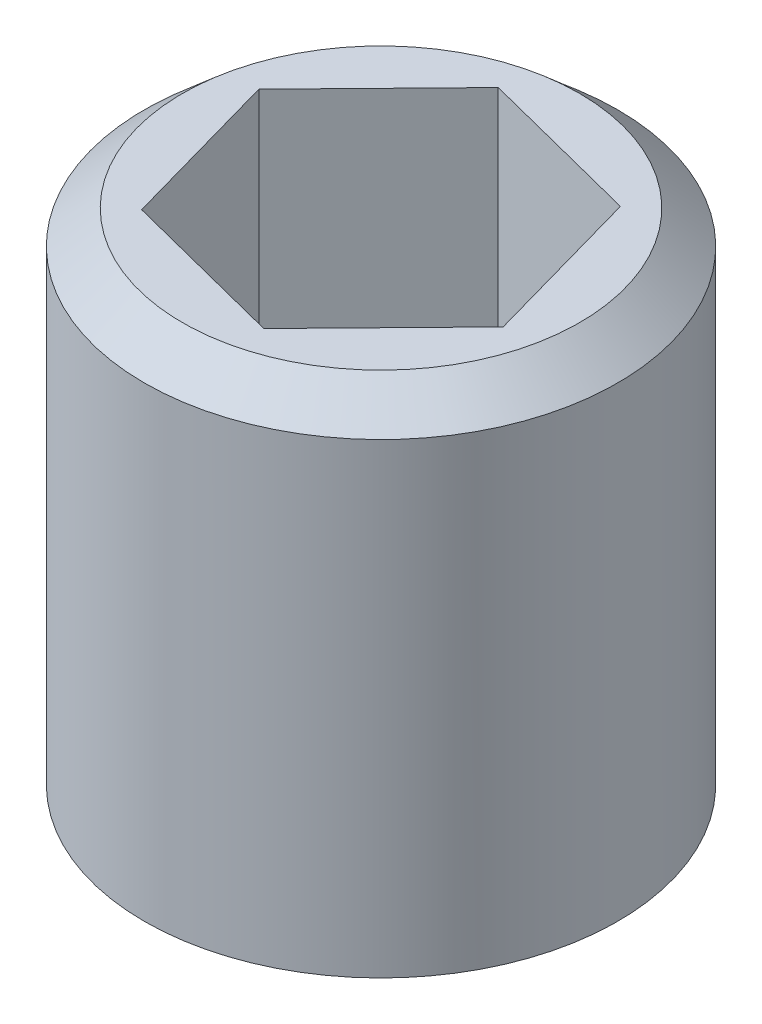
ISO-10303-21;
HEADER;
FILE_DESCRIPTION(('STEP AP214'),'2;1');
FILE_NAME('part.step','',(''),(''),'','','');
FILE_SCHEMA(('AUTOMOTIVE_DESIGN { 1 0 10303 214 1 1 1 1 }'));
ENDSEC;
DATA;
#1=APPLICATION_CONTEXT('core data for automotive mechanical design processes');
#2=APPLICATION_PROTOCOL_DEFINITION('international standard','automotive_design',2000,#1);
#3=PRODUCT_CONTEXT('',#1,'mechanical');
#4=PRODUCT('Part','Part','',(#3));
#5=PRODUCT_RELATED_PRODUCT_CATEGORY('part','',(#4));
#6=PRODUCT_DEFINITION_FORMATION('','',#4);
#7=PRODUCT_DEFINITION_CONTEXT('part definition',#1,'design');
#8=PRODUCT_DEFINITION('design','',#6,#7);
#9=PRODUCT_DEFINITION_SHAPE('','',#8);
#10=(LENGTH_UNIT() NAMED_UNIT(*) SI_UNIT(.MILLI.,.METRE.));
#11=(NAMED_UNIT(*) PLANE_ANGLE_UNIT() SI_UNIT($,.RADIAN.));
#12=(NAMED_UNIT(*) SI_UNIT($,.STERADIAN.) SOLID_ANGLE_UNIT());
#13=UNCERTAINTY_MEASURE_WITH_UNIT(LENGTH_MEASURE(1.E-05),#10,'distance_accuracy_value','');
#14=(GEOMETRIC_REPRESENTATION_CONTEXT(3) GLOBAL_UNCERTAINTY_ASSIGNED_CONTEXT((#13)) GLOBAL_UNIT_ASSIGNED_CONTEXT((#10,
#11,#12)) REPRESENTATION_CONTEXT('',''));
#15=CARTESIAN_POINT('',(0.,0.,0.));
#16=DIRECTION('',(0.,0.,1.));
#17=DIRECTION('',(1.,0.,0.));
#18=AXIS2_PLACEMENT_3D('',#15,#16,#17);
#19=CARTESIAN_POINT('',(-1.11882561285148,6.,2.96440836608743));
#20=DIRECTION('',(-0.962784014676902,0.,0.270271976132611));
#21=DIRECTION('',(0.270271976132611,0.,0.962784014676902));
#22=AXIS2_PLACEMENT_3D('',#19,#20,#21);
#23=PLANE('',#22);
#24=DIRECTION('',(0.,1.,0.));
#25=VECTOR('',#24,1.);
#26=CARTESIAN_POINT('',(-0.806742416502327,6.,4.07613558617779));
#27=LINE('',#26,#25);
#28=CARTESIAN_POINT('',(-0.806742416502328,9.,4.07613558617779));
#29=VERTEX_POINT('',#28);
#30=CARTESIAN_POINT('',(-0.806742416502328,6.,4.07613558617779));
#31=VERTEX_POINT('',#30);
#32=EDGE_CURVE('E83',#29,#31,#27,.F.);
#33=ORIENTED_EDGE('',*,*,#32,.T.);
#34=DIRECTION('',(0.270271976132611,0.,0.962784014676902));
#35=VECTOR('',#34,1.);
#36=CARTESIAN_POINT('',(-1.11882561285148,6.,2.96440836608743));
#37=LINE('',#36,#35);
#38=CARTESIAN_POINT('',(-1.11882561285148,6.,2.96440836608743));
#39=VERTEX_POINT('',#38);
#40=EDGE_CURVE('E72',#39,#31,#37,.T.);
#41=ORIENTED_EDGE('',*,*,#40,.F.);
#42=DIRECTION('',(0.,1.,0.));
#43=VECTOR('',#42,1.);
#44=CARTESIAN_POINT('',(-1.11882561285148,6.,2.96440836608743));
#45=LINE('',#44,#43);
#46=CARTESIAN_POINT('',(-1.11882561285148,9.,2.96440836608743));
#47=VERTEX_POINT('',#46);
#48=EDGE_CURVE('E91',#39,#47,#45,.T.);
#49=ORIENTED_EDGE('',*,*,#48,.T.);
#50=DIRECTION('',(0.270271976132611,0.,0.962784014676902));
#51=VECTOR('',#50,1.);
#52=CARTESIAN_POINT('',(-1.11882561285148,9.,2.96440836608743));
#53=LINE('',#52,#51);
#54=EDGE_CURVE('E67',#29,#47,#53,.F.);
#55=ORIENTED_EDGE('',*,*,#54,.F.);
#56=EDGE_LOOP('',(#33,#41,#49,#55));
#57=FACE_BOUND('',#56,.T.);
#58=ADVANCED_FACE('F17',(#57),#23,.F.);
#59=CARTESIAN_POINT('',(-0.806742416502327,6.,4.07613558617779));
#60=DIRECTION('',(-0.247329610076589,0.,0.968931403134073));
#61=DIRECTION('',(0.968931403134073,0.,0.247329610076589));
#62=AXIS2_PLACEMENT_3D('',#59,#60,#61);
#63=PLANE('',#62);
#64=DIRECTION('',(0.,1.,0.));
#65=VECTOR('',#64,1.);
#66=CARTESIAN_POINT('',(0.312083196349151,6.,4.36172722009036));
#67=LINE('',#66,#65);
#68=CARTESIAN_POINT('',(0.312083196349152,9.,4.36172722009036));
#69=VERTEX_POINT('',#68);
#70=CARTESIAN_POINT('',(0.312083196349151,6.,4.36172722009036));
#71=VERTEX_POINT('',#70);
#72=EDGE_CURVE('E87',#69,#71,#67,.F.);
#73=ORIENTED_EDGE('',*,*,#72,.T.);
#74=DIRECTION('',(0.968931403134073,0.,0.247329610076589));
#75=VECTOR('',#74,1.);
#76=CARTESIAN_POINT('',(-0.806742416502327,6.,4.07613558617779));
#77=LINE('',#76,#75);
#78=EDGE_CURVE('E76',#31,#71,#77,.T.);
#79=ORIENTED_EDGE('',*,*,#78,.F.);
#80=ORIENTED_EDGE('',*,*,#32,.F.);
#81=DIRECTION('',(0.968931403134073,0.,0.247329610076589));
#82=VECTOR('',#81,1.);
#83=CARTESIAN_POINT('',(-0.806742416502327,9.,4.07613558617779));
#84=LINE('',#83,#82);
#85=EDGE_CURVE('E89',#69,#29,#84,.F.);
#86=ORIENTED_EDGE('',*,*,#85,.F.);
#87=EDGE_LOOP('',(#73,#79,#80,#86));
#88=FACE_BOUND('',#87,.T.);
#89=ADVANCED_FACE('F86',(#88),#63,.F.);
#90=CARTESIAN_POINT('',(-0.31208319634915,6.,2.13827277990964));
#91=DIRECTION('',(-0.715454404600314,0.,-0.698659427001461));
#92=DIRECTION('',(-0.698659427001461,0.,0.715454404600314));
#93=AXIS2_PLACEMENT_3D('',#90,#91,#92);
#94=PLANE('',#93);
#95=ORIENTED_EDGE('',*,*,#48,.F.);
#96=DIRECTION('',(-0.698659427001463,0.,0.715454404600313));
#97=VECTOR('',#96,1.);
#98=CARTESIAN_POINT('',(-0.31208319634915,6.,2.13827277990964));
#99=LINE('',#98,#97);
#100=CARTESIAN_POINT('',(-0.31208319634915,6.,2.13827277990964));
#101=VERTEX_POINT('',#100);
#102=EDGE_CURVE('E79',#101,#39,#99,.T.);
#103=ORIENTED_EDGE('',*,*,#102,.F.);
#104=DIRECTION('',(0.,1.,0.));
#105=VECTOR('',#104,1.);
#106=CARTESIAN_POINT('',(-0.312083196349151,6.,2.13827277990964));
#107=LINE('',#106,#105);
#108=CARTESIAN_POINT('',(-0.31208319634915,9.,2.13827277990964));
#109=VERTEX_POINT('',#108);
#110=EDGE_CURVE('E120',#101,#109,#107,.T.);
#111=ORIENTED_EDGE('',*,*,#110,.T.);
#112=DIRECTION('',(-0.698659427001461,0.,0.715454404600314));
#113=VECTOR('',#112,1.);
#114=CARTESIAN_POINT('',(-0.31208319634915,9.,2.13827277990964));
#115=LINE('',#114,#113);
#116=EDGE_CURVE('E130',#47,#109,#115,.F.);
#117=ORIENTED_EDGE('',*,*,#116,.F.);
#118=EDGE_LOOP('',(#95,#103,#111,#117));
#119=FACE_BOUND('',#118,.T.);
#120=ADVANCED_FACE('F133',(#119),#94,.F.);
#121=CARTESIAN_POINT('',(0.312083196349151,6.,4.36172722009036));
#122=DIRECTION('',(0.715454404600314,0.,0.698659427001461));
#123=DIRECTION('',(0.698659427001461,0.,-0.715454404600314));
#124=AXIS2_PLACEMENT_3D('',#121,#122,#123);
#125=PLANE('',#124);
#126=DIRECTION('',(0.,1.,0.));
#127=VECTOR('',#126,1.);
#128=CARTESIAN_POINT('',(1.11882561285148,6.,3.53559163391257));
#129=LINE('',#128,#127);
#130=CARTESIAN_POINT('',(1.11882561285148,9.,3.53559163391257));
#131=VERTEX_POINT('',#130);
#132=CARTESIAN_POINT('',(1.11882561285148,6.,3.53559163391257));
#133=VERTEX_POINT('',#132);
#134=EDGE_CURVE('E116',#131,#133,#129,.F.);
#135=ORIENTED_EDGE('',*,*,#134,.T.);
#136=DIRECTION('',(0.698659427001462,0.,-0.715454404600313));
#137=VECTOR('',#136,1.);
#138=CARTESIAN_POINT('',(0.312083196349151,6.,4.36172722009036));
#139=LINE('',#138,#137);
#140=EDGE_CURVE('E126',#71,#133,#139,.T.);
#141=ORIENTED_EDGE('',*,*,#140,.F.);
#142=ORIENTED_EDGE('',*,*,#72,.F.);
#143=DIRECTION('',(0.698659427001461,0.,-0.715454404600314));
#144=VECTOR('',#143,1.);
#145=CARTESIAN_POINT('',(0.312083196349151,9.,4.36172722009036));
#146=LINE('',#145,#144);
#147=EDGE_CURVE('E35',#131,#69,#146,.F.);
#148=ORIENTED_EDGE('',*,*,#147,.F.);
#149=EDGE_LOOP('',(#135,#141,#142,#148));
#150=FACE_BOUND('',#149,.T.);
#151=ADVANCED_FACE('F138',(#150),#125,.F.);
#152=CARTESIAN_POINT('',(0.,6.,0.));
#153=DIRECTION('',(0.,1.,0.));
#154=DIRECTION('',(0.,0.,1.));
#155=AXIS2_PLACEMENT_3D('',#152,#153,#154);
#156=PLANE('',#155);
#157=ORIENTED_EDGE('',*,*,#40,.T.);
#158=ORIENTED_EDGE('',*,*,#78,.T.);
#159=ORIENTED_EDGE('',*,*,#140,.T.);
#160=DIRECTION('',(-0.270271976132611,0.,-0.962784014676902));
#161=VECTOR('',#160,1.);
#162=CARTESIAN_POINT('',(1.11882561285148,6.,3.53559163391257));
#163=LINE('',#162,#161);
#164=CARTESIAN_POINT('',(0.806742416502327,6.,2.42386441382221));
#165=VERTEX_POINT('',#164);
#166=EDGE_CURVE('E112',#133,#165,#163,.T.);
#167=ORIENTED_EDGE('',*,*,#166,.T.);
#168=DIRECTION('',(-0.968931403134073,0.,-0.247329610076588));
#169=VECTOR('',#168,1.);
#170=CARTESIAN_POINT('',(0.806742416502327,6.,2.42386441382221));
#171=LINE('',#170,#169);
#172=EDGE_CURVE('E123',#165,#101,#171,.T.);
#173=ORIENTED_EDGE('',*,*,#172,.T.);
#174=ORIENTED_EDGE('',*,*,#102,.T.);
#175=EDGE_LOOP('',(#157,#158,#159,#167,#173,#174));
#176=FACE_BOUND('',#175,.T.);
#177=ADVANCED_FACE('F73',(#176),#156,.T.);
#178=CARTESIAN_POINT('',(0.806742416502327,6.,2.42386441382221));
#179=DIRECTION('',(0.247329610076588,0.,-0.968931403134073));
#180=DIRECTION('',(-0.968931403134073,0.,-0.247329610076588));
#181=AXIS2_PLACEMENT_3D('',#178,#179,#180);
#182=PLANE('',#181);
#183=ORIENTED_EDGE('',*,*,#110,.F.);
#184=ORIENTED_EDGE('',*,*,#172,.F.);
#185=DIRECTION('',(0.,1.,0.));
#186=VECTOR('',#185,1.);
#187=CARTESIAN_POINT('',(0.806742416502329,6.,2.42386441382221));
#188=LINE('',#187,#186);
#189=CARTESIAN_POINT('',(0.806742416502327,9.,2.42386441382221));
#190=VERTEX_POINT('',#189);
#191=EDGE_CURVE('E106',#165,#190,#188,.T.);
#192=ORIENTED_EDGE('',*,*,#191,.T.);
#193=DIRECTION('',(-0.968931403134073,0.,-0.247329610076588));
#194=VECTOR('',#193,1.);
#195=CARTESIAN_POINT('',(0.806742416502327,9.,2.42386441382221));
#196=LINE('',#195,#194);
#197=EDGE_CURVE('E117',#109,#190,#196,.F.);
#198=ORIENTED_EDGE('',*,*,#197,.F.);
#199=EDGE_LOOP('',(#183,#184,#192,#198));
#200=FACE_BOUND('',#199,.T.);
#201=ADVANCED_FACE('F143',(#200),#182,.F.);
#202=CARTESIAN_POINT('',(1.11882561285148,6.,3.53559163391257));
#203=DIRECTION('',(0.962784014676902,0.,-0.270271976132611));
#204=DIRECTION('',(-0.270271976132611,0.,-0.962784014676902));
#205=AXIS2_PLACEMENT_3D('',#202,#203,#204);
#206=PLANE('',#205);
#207=ORIENTED_EDGE('',*,*,#191,.F.);
#208=ORIENTED_EDGE('',*,*,#166,.F.);
#209=ORIENTED_EDGE('',*,*,#134,.F.);
#210=DIRECTION('',(-0.270271976132612,0.,-0.962784014676902));
#211=VECTOR('',#210,1.);
#212=CARTESIAN_POINT('',(1.11882561285148,9.,3.53559163391257));
#213=LINE('',#212,#211);
#214=EDGE_CURVE('E102',#131,#190,#213,.T.);
#215=ORIENTED_EDGE('',*,*,#214,.T.);
#216=EDGE_LOOP('',(#207,#208,#209,#215));
#217=FACE_BOUND('',#216,.T.);
#218=ADVANCED_FACE('F141',(#217),#206,.F.);
#219=CARTESIAN_POINT('',(0.,5.,3.84582802539439));
#220=DIRECTION('',(0.,1.,0.));
#221=DIRECTION('',(0.,0.,1.));
#222=AXIS2_PLACEMENT_3D('',#219,#220,#221);
#223=PLANE('',#222);
#224=CARTESIAN_POINT('',(0.,4.99999999998334,3.25));
#225=DIRECTION('',(0.,1.,0.));
#226=DIRECTION('',(0.,0.,1.));
#227=AXIS2_PLACEMENT_3D('',#224,#225,#226);
#228=CIRCLE('',#227,0.595828025325318);
#229=CARTESIAN_POINT('',(0.,4.99999999998334,3.84582802532532));
#230=VERTEX_POINT('',#229);
#231=EDGE_CURVE('E20',#230,#230,#228,.T.);
#232=ORIENTED_EDGE('',*,*,#231,.F.);
#233=EDGE_LOOP('',(#232));
#234=FACE_BOUND('',#233,.T.);
#235=ADVANCED_FACE('F151',(#234),#223,.F.);
#236=CARTESIAN_POINT('',(0.,9.,3.25));
#237=DIRECTION('',(0.,-1.,0.));
#238=DIRECTION('',(0.,0.,-1.));
#239=AXIS2_PLACEMENT_3D('',#236,#237,#238);
#240=PLANE('',#239);
#241=CARTESIAN_POINT('',(0.,8.99999999998247,3.25));
#242=DIRECTION('',(0.,-1.,0.));
#243=DIRECTION('',(0.,0.,-1.));
#244=AXIS2_PLACEMENT_3D('',#241,#242,#243);
#245=CIRCLE('',#244,1.35442592875279);
#246=CARTESIAN_POINT('',(0.,8.99999999998247,1.89557407124721));
#247=VERTEX_POINT('',#246);
#248=EDGE_CURVE('E95',#247,#247,#245,.T.);
#249=ORIENTED_EDGE('',*,*,#248,.F.);
#250=EDGE_LOOP('',(#249));
#251=FACE_BOUND('',#250,.T.);
#252=ORIENTED_EDGE('',*,*,#147,.T.);
#253=ORIENTED_EDGE('',*,*,#85,.T.);
#254=ORIENTED_EDGE('',*,*,#54,.T.);
#255=ORIENTED_EDGE('',*,*,#116,.T.);
#256=ORIENTED_EDGE('',*,*,#197,.T.);
#257=ORIENTED_EDGE('',*,*,#214,.F.);
#258=EDGE_LOOP('',(#252,#253,#254,#255,#256,#257));
#259=FACE_BOUND('',#258,.T.);
#260=ADVANCED_FACE('F137',(#251,#259),#240,.F.);
#261=CARTESIAN_POINT('',(0.,5.59286359862199,3.25));
#262=DIRECTION('',(0.,1.,0.));
#263=DIRECTION('',(0.,0.,1.));
#264=AXIS2_PLACEMENT_3D('',#261,#262,#263);
#265=CONICAL_SURFACE('',#264,1.61433728457314,1.04365038322902);
#266=CARTESIAN_POINT('',(0.,5.59286359862151,3.25));
#267=DIRECTION('',(0.,1.,0.));
#268=DIRECTION('',(0.,0.,1.));
#269=AXIS2_PLACEMENT_3D('',#266,#267,#268);
#270=CIRCLE('',#269,1.61433728456468);
#271=CARTESIAN_POINT('',(0.,5.59286359862151,4.86433728456468));
#272=VERTEX_POINT('',#271);
#273=EDGE_CURVE('E26',#272,#272,#270,.T.);
#274=ORIENTED_EDGE('',*,*,#273,.F.);
#275=EDGE_LOOP('',(#274));
#276=FACE_BOUND('',#275,.T.);
#277=ORIENTED_EDGE('',*,*,#231,.T.);
#278=EDGE_LOOP('',(#277));
#279=FACE_BOUND('',#278,.T.);
#280=ADVANCED_FACE('F162',(#276,#279),#265,.T.);
#281=CARTESIAN_POINT('',(0.,8.77366078282193,3.25));
#282=DIRECTION('',(0.,-1.,0.));
#283=DIRECTION('',(0.,0.,-1.));
#284=AXIS2_PLACEMENT_3D('',#281,#282,#283);
#285=CONICAL_SURFACE('',#284,1.61433728461316,0.854331646248377);
#286=ORIENTED_EDGE('',*,*,#248,.T.);
#287=EDGE_LOOP('',(#286));
#288=FACE_BOUND('',#287,.T.);
#289=CARTESIAN_POINT('',(0.,8.7736607828091,3.25));
#290=DIRECTION('',(0.,1.,0.));
#291=DIRECTION('',(0.,0.,1.));
#292=AXIS2_PLACEMENT_3D('',#289,#290,#291);
#293=CIRCLE('',#292,1.61433728456468);
#294=CARTESIAN_POINT('',(0.,8.7736607828091,4.86433728456468));
#295=VERTEX_POINT('',#294);
#296=EDGE_CURVE('E11',#295,#295,#293,.F.);
#297=ORIENTED_EDGE('',*,*,#296,.F.);
#298=EDGE_LOOP('',(#297));
#299=FACE_BOUND('',#298,.T.);
#300=ADVANCED_FACE('F156',(#288,#299),#285,.T.);
#301=CARTESIAN_POINT('',(0.,1.49143096545149,3.25));
#302=DIRECTION('',(0.,1.,0.));
#303=DIRECTION('',(0.,0.,1.));
#304=AXIS2_PLACEMENT_3D('',#301,#302,#303);
#305=CYLINDRICAL_SURFACE('',#304,1.61433728456468);
#306=ORIENTED_EDGE('',*,*,#273,.T.);
#307=EDGE_LOOP('',(#306));
#308=FACE_BOUND('',#307,.T.);
#309=ORIENTED_EDGE('',*,*,#296,.T.);
#310=EDGE_LOOP('',(#309));
#311=FACE_BOUND('',#310,.T.);
#312=ADVANCED_FACE('F154',(#308,#311),#305,.T.);
#313=CLOSED_SHELL('',(#58,#89,#120,#151,#177,#201,#218,#235,#260,#280,#300,#312));
#314=MANIFOLD_SOLID_BREP('B1',#313);
#315=ADVANCED_BREP_SHAPE_REPRESENTATION('',(#18,#314),#14);
#316=SHAPE_DEFINITION_REPRESENTATION(#9,#315);
ENDSEC;
END-ISO-10303-21;
